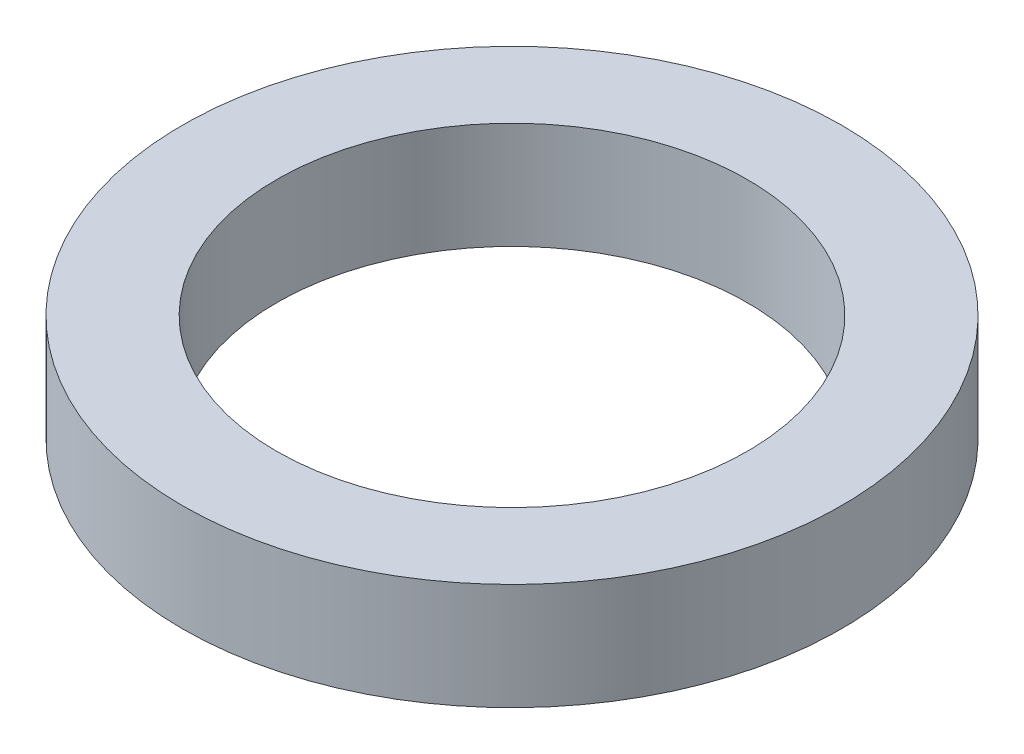
ISO-10303-21;
HEADER;
FILE_DESCRIPTION(('STEP AP214'),'2;1');
FILE_NAME('part.step','',(''),(''),'','','');
FILE_SCHEMA(('AUTOMOTIVE_DESIGN { 1 0 10303 214 1 1 1 1 }'));
ENDSEC;
DATA;
#1=APPLICATION_CONTEXT('core data for automotive mechanical design processes');
#2=APPLICATION_PROTOCOL_DEFINITION('international standard','automotive_design',2000,#1);
#3=PRODUCT_CONTEXT('',#1,'mechanical');
#4=PRODUCT('Part','Part','',(#3));
#5=PRODUCT_RELATED_PRODUCT_CATEGORY('part','',(#4));
#6=PRODUCT_DEFINITION_FORMATION('','',#4);
#7=PRODUCT_DEFINITION_CONTEXT('part definition',#1,'design');
#8=PRODUCT_DEFINITION('design','',#6,#7);
#9=PRODUCT_DEFINITION_SHAPE('','',#8);
#10=(LENGTH_UNIT() NAMED_UNIT(*) SI_UNIT(.MILLI.,.METRE.));
#11=(NAMED_UNIT(*) PLANE_ANGLE_UNIT() SI_UNIT($,.RADIAN.));
#12=(NAMED_UNIT(*) SI_UNIT($,.STERADIAN.) SOLID_ANGLE_UNIT());
#13=UNCERTAINTY_MEASURE_WITH_UNIT(LENGTH_MEASURE(1.E-05),#10,'distance_accuracy_value','');
#14=(GEOMETRIC_REPRESENTATION_CONTEXT(3) GLOBAL_UNCERTAINTY_ASSIGNED_CONTEXT((#13)) GLOBAL_UNIT_ASSIGNED_CONTEXT((#10,
#11,#12)) REPRESENTATION_CONTEXT('',''));
#15=CARTESIAN_POINT('',(0.,0.,0.));
#16=DIRECTION('',(0.,0.,1.));
#17=DIRECTION('',(1.,0.,0.));
#18=AXIS2_PLACEMENT_3D('',#15,#16,#17);
#19=CARTESIAN_POINT('',(0.,17.,0.));
#20=DIRECTION('',(0.,-1.,0.));
#21=DIRECTION('',(0.,0.,-1.));
#22=AXIS2_PLACEMENT_3D('',#19,#20,#21);
#23=CYLINDRICAL_SURFACE('',#22,52.5);
#24=CARTESIAN_POINT('',(0.,17.,0.));
#25=DIRECTION('',(0.,1.,0.));
#26=DIRECTION('',(0.,0.,1.));
#27=AXIS2_PLACEMENT_3D('',#24,#25,#26);
#28=CIRCLE('',#27,52.5);
#29=CARTESIAN_POINT('',(0.,17.,52.5));
#30=VERTEX_POINT('',#29);
#31=EDGE_CURVE('E10',#30,#30,#28,.T.);
#32=ORIENTED_EDGE('',*,*,#31,.F.);
#33=EDGE_LOOP('',(#32));
#34=FACE_BOUND('',#33,.T.);
#35=CARTESIAN_POINT('',(0.,0.,0.));
#36=DIRECTION('',(0.,1.,0.));
#37=DIRECTION('',(0.,0.,1.));
#38=AXIS2_PLACEMENT_3D('',#35,#36,#37);
#39=CIRCLE('',#38,52.5);
#40=CARTESIAN_POINT('',(0.,0.,52.5));
#41=VERTEX_POINT('',#40);
#42=EDGE_CURVE('E37',#41,#41,#39,.T.);
#43=ORIENTED_EDGE('',*,*,#42,.T.);
#44=EDGE_LOOP('',(#43));
#45=FACE_BOUND('',#44,.T.);
#46=ADVANCED_FACE('F40',(#34,#45),#23,.T.);
#47=CARTESIAN_POINT('',(0.,17.,0.));
#48=DIRECTION('',(0.,1.,0.));
#49=DIRECTION('',(0.,0.,1.));
#50=AXIS2_PLACEMENT_3D('',#47,#48,#49);
#51=PLANE('',#50);
#52=CARTESIAN_POINT('',(0.,17.,0.));
#53=DIRECTION('',(0.,1.,0.));
#54=DIRECTION('',(0.,0.,1.));
#55=AXIS2_PLACEMENT_3D('',#52,#53,#54);
#56=CIRCLE('',#55,37.5);
#57=CARTESIAN_POINT('',(0.,17.,37.5));
#58=VERTEX_POINT('',#57);
#59=EDGE_CURVE('E50',#58,#58,#56,.T.);
#60=ORIENTED_EDGE('',*,*,#59,.F.);
#61=EDGE_LOOP('',(#60));
#62=FACE_BOUND('',#61,.T.);
#63=ORIENTED_EDGE('',*,*,#31,.T.);
#64=EDGE_LOOP('',(#63));
#65=FACE_BOUND('',#64,.T.);
#66=ADVANCED_FACE('F59',(#62,#65),#51,.T.);
#67=CARTESIAN_POINT('',(0.,0.,0.));
#68=DIRECTION('',(0.,1.,0.));
#69=DIRECTION('',(0.,0.,1.));
#70=AXIS2_PLACEMENT_3D('',#67,#68,#69);
#71=PLANE('',#70);
#72=CARTESIAN_POINT('',(0.,0.,0.));
#73=DIRECTION('',(0.,1.,0.));
#74=DIRECTION('',(0.,0.,1.));
#75=AXIS2_PLACEMENT_3D('',#72,#73,#74);
#76=CIRCLE('',#75,37.5);
#77=CARTESIAN_POINT('',(0.,0.,37.5));
#78=VERTEX_POINT('',#77);
#79=EDGE_CURVE('E47',#78,#78,#76,.T.);
#80=ORIENTED_EDGE('',*,*,#79,.T.);
#81=EDGE_LOOP('',(#80));
#82=FACE_BOUND('',#81,.T.);
#83=ORIENTED_EDGE('',*,*,#42,.F.);
#84=EDGE_LOOP('',(#83));
#85=FACE_BOUND('',#84,.T.);
#86=ADVANCED_FACE('F58',(#82,#85),#71,.F.);
#87=CARTESIAN_POINT('',(0.,17.,0.));
#88=DIRECTION('',(0.,-1.,0.));
#89=DIRECTION('',(0.,0.,-1.));
#90=AXIS2_PLACEMENT_3D('',#87,#88,#89);
#91=CYLINDRICAL_SURFACE('',#90,37.5);
#92=ORIENTED_EDGE('',*,*,#59,.T.);
#93=EDGE_LOOP('',(#92));
#94=FACE_BOUND('',#93,.T.);
#95=ORIENTED_EDGE('',*,*,#79,.F.);
#96=EDGE_LOOP('',(#95));
#97=FACE_BOUND('',#96,.T.);
#98=ADVANCED_FACE('F54',(#94,#97),#91,.F.);
#99=CLOSED_SHELL('',(#46,#66,#86,#98));
#100=MANIFOLD_SOLID_BREP('B2',#99);
#101=ADVANCED_BREP_SHAPE_REPRESENTATION('',(#18,#100),#14);
#102=SHAPE_DEFINITION_REPRESENTATION(#9,#101);
ENDSEC;
END-ISO-10303-21;
